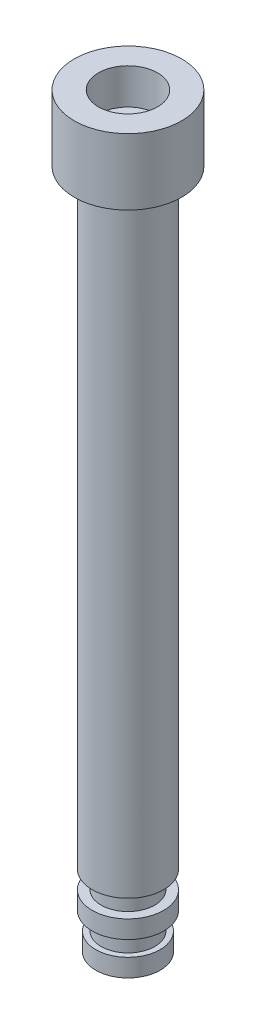
ISO-10303-21;
HEADER;
FILE_DESCRIPTION(('STEP AP214'),'2;1');
FILE_NAME('part.step','',(''),(''),'','','');
FILE_SCHEMA(('AUTOMOTIVE_DESIGN { 1 0 10303 214 1 1 1 1 }'));
ENDSEC;
DATA;
#1=APPLICATION_CONTEXT('core data for automotive mechanical design processes');
#2=APPLICATION_PROTOCOL_DEFINITION('international standard','automotive_design',2000,#1);
#3=PRODUCT_CONTEXT('',#1,'mechanical');
#4=PRODUCT('Part','Part','',(#3));
#5=PRODUCT_RELATED_PRODUCT_CATEGORY('part','',(#4));
#6=PRODUCT_DEFINITION_FORMATION('','',#4);
#7=PRODUCT_DEFINITION_CONTEXT('part definition',#1,'design');
#8=PRODUCT_DEFINITION('design','',#6,#7);
#9=PRODUCT_DEFINITION_SHAPE('','',#8);
#10=(LENGTH_UNIT() NAMED_UNIT(*) SI_UNIT(.MILLI.,.METRE.));
#11=(NAMED_UNIT(*) PLANE_ANGLE_UNIT() SI_UNIT($,.RADIAN.));
#12=(NAMED_UNIT(*) SI_UNIT($,.STERADIAN.) SOLID_ANGLE_UNIT());
#13=UNCERTAINTY_MEASURE_WITH_UNIT(LENGTH_MEASURE(1.E-05),#10,'distance_accuracy_value','');
#14=(GEOMETRIC_REPRESENTATION_CONTEXT(3) GLOBAL_UNCERTAINTY_ASSIGNED_CONTEXT((#13)) GLOBAL_UNIT_ASSIGNED_CONTEXT((#10,
#11,#12)) REPRESENTATION_CONTEXT('',''));
#15=CARTESIAN_POINT('',(0.,0.,0.));
#16=DIRECTION('',(0.,0.,1.));
#17=DIRECTION('',(1.,0.,0.));
#18=AXIS2_PLACEMENT_3D('',#15,#16,#17);
#19=CARTESIAN_POINT('',(-0.522013311509166,-38.,-0.51113803418606));
#20=DIRECTION('',(0.,1.,0.));
#21=DIRECTION('',(0.,0.,1.));
#22=AXIS2_PLACEMENT_3D('',#19,#20,#21);
#23=CYLINDRICAL_SURFACE('',#22,1.5);
#24=CARTESIAN_POINT('',(-0.522013311509166,-36.,-0.51113803418606));
#25=DIRECTION('',(0.,-1.,0.));
#26=DIRECTION('',(0.,0.,-1.));
#27=AXIS2_PLACEMENT_3D('',#24,#25,#26);
#28=CIRCLE('',#27,1.5);
#29=CARTESIAN_POINT('',(-0.522013311509166,-36.,-2.01113803418606));
#30=VERTEX_POINT('',#29);
#31=EDGE_CURVE('E58',#30,#30,#28,.T.);
#32=ORIENTED_EDGE('',*,*,#31,.T.);
#33=EDGE_LOOP('',(#32));
#34=FACE_BOUND('',#33,.T.);
#35=CARTESIAN_POINT('',(-0.522013311509166,-37.,-0.51113803418606));
#36=DIRECTION('',(0.,-1.,0.));
#37=DIRECTION('',(0.,0.,-1.));
#38=AXIS2_PLACEMENT_3D('',#35,#36,#37);
#39=CIRCLE('',#38,1.5);
#40=CARTESIAN_POINT('',(-0.522013311509166,-37.,-2.01113803418606));
#41=VERTEX_POINT('',#40);
#42=EDGE_CURVE('E53',#41,#41,#39,.T.);
#43=ORIENTED_EDGE('',*,*,#42,.F.);
#44=EDGE_LOOP('',(#43));
#45=FACE_BOUND('',#44,.T.);
#46=ADVANCED_FACE('F45',(#34,#45),#23,.T.);
#47=CARTESIAN_POINT('',(-0.522013311509166,-35.,-0.51113803418606));
#48=DIRECTION('',(0.,1.,0.));
#49=DIRECTION('',(0.,0.,1.));
#50=AXIS2_PLACEMENT_3D('',#47,#48,#49);
#51=CYLINDRICAL_SURFACE('',#50,1.5);
#52=CARTESIAN_POINT('',(-0.522013311509166,-34.,-0.51113803418606));
#53=DIRECTION('',(0.,-1.,0.));
#54=DIRECTION('',(0.,0.,-1.));
#55=AXIS2_PLACEMENT_3D('',#52,#53,#54);
#56=CIRCLE('',#55,1.5);
#57=CARTESIAN_POINT('',(-0.522013311509166,-34.,-2.01113803418606));
#58=VERTEX_POINT('',#57);
#59=EDGE_CURVE('E69',#58,#58,#56,.T.);
#60=ORIENTED_EDGE('',*,*,#59,.T.);
#61=EDGE_LOOP('',(#60));
#62=FACE_BOUND('',#61,.T.);
#63=CARTESIAN_POINT('',(-0.522013311509166,-35.,-0.51113803418606));
#64=DIRECTION('',(0.,-1.,0.));
#65=DIRECTION('',(0.,0.,-1.));
#66=AXIS2_PLACEMENT_3D('',#63,#64,#65);
#67=CIRCLE('',#66,1.5);
#68=CARTESIAN_POINT('',(-0.522013311509166,-35.,-2.01113803418606));
#69=VERTEX_POINT('',#68);
#70=EDGE_CURVE('E102',#69,#69,#67,.T.);
#71=ORIENTED_EDGE('',*,*,#70,.F.);
#72=EDGE_LOOP('',(#71));
#73=FACE_BOUND('',#72,.T.);
#74=ADVANCED_FACE('F127',(#62,#73),#51,.T.);
#75=CARTESIAN_POINT('',(-0.522013311509166,-36.,-0.51113803418606));
#76=DIRECTION('',(0.,1.,0.));
#77=DIRECTION('',(0.,0.,1.));
#78=AXIS2_PLACEMENT_3D('',#75,#76,#77);
#79=CYLINDRICAL_SURFACE('',#78,2.);
#80=CARTESIAN_POINT('',(-0.522013311509166,-36.,-0.51113803418606));
#81=DIRECTION('',(0.,-1.,0.));
#82=DIRECTION('',(0.,0.,-1.));
#83=AXIS2_PLACEMENT_3D('',#80,#81,#82);
#84=CIRCLE('',#83,2.);
#85=CARTESIAN_POINT('',(-0.522013311509166,-36.,-2.51113803418606));
#86=VERTEX_POINT('',#85);
#87=EDGE_CURVE('E98',#86,#86,#84,.T.);
#88=ORIENTED_EDGE('',*,*,#87,.F.);
#89=EDGE_LOOP('',(#88));
#90=FACE_BOUND('',#89,.T.);
#91=CARTESIAN_POINT('',(-0.522013311509166,-35.,-0.51113803418606));
#92=DIRECTION('',(0.,-1.,0.));
#93=DIRECTION('',(0.,0.,-1.));
#94=AXIS2_PLACEMENT_3D('',#91,#92,#93);
#95=CIRCLE('',#94,2.);
#96=CARTESIAN_POINT('',(-0.522013311509166,-35.,-2.51113803418606));
#97=VERTEX_POINT('',#96);
#98=EDGE_CURVE('E94',#97,#97,#95,.T.);
#99=ORIENTED_EDGE('',*,*,#98,.T.);
#100=EDGE_LOOP('',(#99));
#101=FACE_BOUND('',#100,.T.);
#102=ADVANCED_FACE('F133',(#90,#101),#79,.T.);
#103=CARTESIAN_POINT('',(-0.522013311509166,-36.,-0.51113803418606));
#104=DIRECTION('',(0.,-1.,0.));
#105=DIRECTION('',(0.,0.,-1.));
#106=AXIS2_PLACEMENT_3D('',#103,#104,#105);
#107=PLANE('',#106);
#108=ORIENTED_EDGE('',*,*,#31,.F.);
#109=EDGE_LOOP('',(#108));
#110=FACE_BOUND('',#109,.T.);
#111=ORIENTED_EDGE('',*,*,#87,.T.);
#112=EDGE_LOOP('',(#111));
#113=FACE_BOUND('',#112,.T.);
#114=ADVANCED_FACE('F140',(#110,#113),#107,.T.);
#115=CARTESIAN_POINT('',(-0.522013311509166,-35.,-0.51113803418606));
#116=DIRECTION('',(0.,-1.,0.));
#117=DIRECTION('',(0.,0.,-1.));
#118=AXIS2_PLACEMENT_3D('',#115,#116,#117);
#119=PLANE('',#118);
#120=ORIENTED_EDGE('',*,*,#70,.T.);
#121=EDGE_LOOP('',(#120));
#122=FACE_BOUND('',#121,.T.);
#123=ORIENTED_EDGE('',*,*,#98,.F.);
#124=EDGE_LOOP('',(#123));
#125=FACE_BOUND('',#124,.T.);
#126=ADVANCED_FACE('F143',(#122,#125),#119,.F.);
#127=CARTESIAN_POINT('',(-0.522013311509166,-37.,-0.51113803418606));
#128=DIRECTION('',(0.,-1.,0.));
#129=DIRECTION('',(0.,0.,-1.));
#130=AXIS2_PLACEMENT_3D('',#127,#128,#129);
#131=CYLINDRICAL_SURFACE('',#130,1.8);
#132=CARTESIAN_POINT('',(-0.522013311509166,-37.,-0.51113803418606));
#133=DIRECTION('',(0.,-1.,0.));
#134=DIRECTION('',(0.,0.,-1.));
#135=AXIS2_PLACEMENT_3D('',#132,#133,#134);
#136=CIRCLE('',#135,1.8);
#137=CARTESIAN_POINT('',(-0.522013311509166,-37.,-2.31113803418606));
#138=VERTEX_POINT('',#137);
#139=EDGE_CURVE('E90',#138,#138,#136,.T.);
#140=ORIENTED_EDGE('',*,*,#139,.T.);
#141=EDGE_LOOP('',(#140));
#142=FACE_BOUND('',#141,.T.);
#143=CARTESIAN_POINT('',(-0.522013311509166,-38.,-0.51113803418606));
#144=DIRECTION('',(0.,-1.,0.));
#145=DIRECTION('',(0.,0.,-1.));
#146=AXIS2_PLACEMENT_3D('',#143,#144,#145);
#147=CIRCLE('',#146,1.8);
#148=CARTESIAN_POINT('',(-0.522013311509166,-38.,-2.31113803418606));
#149=VERTEX_POINT('',#148);
#150=EDGE_CURVE('E88',#149,#149,#147,.T.);
#151=ORIENTED_EDGE('',*,*,#150,.F.);
#152=EDGE_LOOP('',(#151));
#153=FACE_BOUND('',#152,.T.);
#154=ADVANCED_FACE('F147',(#142,#153),#131,.T.);
#155=CARTESIAN_POINT('',(-0.522013311509166,-37.,-0.51113803418606));
#156=DIRECTION('',(0.,-1.,0.));
#157=DIRECTION('',(0.,0.,-1.));
#158=AXIS2_PLACEMENT_3D('',#155,#156,#157);
#159=PLANE('',#158);
#160=ORIENTED_EDGE('',*,*,#42,.T.);
#161=EDGE_LOOP('',(#160));
#162=FACE_BOUND('',#161,.T.);
#163=ORIENTED_EDGE('',*,*,#139,.F.);
#164=EDGE_LOOP('',(#163));
#165=FACE_BOUND('',#164,.T.);
#166=ADVANCED_FACE('F171',(#162,#165),#159,.F.);
#167=CARTESIAN_POINT('',(-0.522013311509166,-38.,-0.51113803418606));
#168=DIRECTION('',(0.,-1.,0.));
#169=DIRECTION('',(0.,0.,-1.));
#170=AXIS2_PLACEMENT_3D('',#167,#168,#169);
#171=PLANE('',#170);
#172=ORIENTED_EDGE('',*,*,#150,.T.);
#173=EDGE_LOOP('',(#172));
#174=FACE_BOUND('',#173,.T.);
#175=ADVANCED_FACE('F138',(#174),#171,.T.);
#176=CARTESIAN_POINT('',(-0.522013311509166,-34.,-0.51113803418606));
#177=DIRECTION('',(0.,1.,0.));
#178=DIRECTION('',(0.,0.,1.));
#179=AXIS2_PLACEMENT_3D('',#176,#177,#178);
#180=CYLINDRICAL_SURFACE('',#179,2.);
#181=CARTESIAN_POINT('',(-0.522013311509166,-34.,-0.51113803418606));
#182=DIRECTION('',(0.,-1.,0.));
#183=DIRECTION('',(0.,0.,-1.));
#184=AXIS2_PLACEMENT_3D('',#181,#182,#183);
#185=CIRCLE('',#184,2.);
#186=CARTESIAN_POINT('',(-0.522013311509166,-34.,-2.51113803418606));
#187=VERTEX_POINT('',#186);
#188=EDGE_CURVE('E73',#187,#187,#185,.T.);
#189=ORIENTED_EDGE('',*,*,#188,.F.);
#190=EDGE_LOOP('',(#189));
#191=FACE_BOUND('',#190,.T.);
#192=CARTESIAN_POINT('',(-0.522013311509166,0.,-0.51113803418606));
#193=DIRECTION('',(0.,1.,0.));
#194=DIRECTION('',(0.,0.,1.));
#195=AXIS2_PLACEMENT_3D('',#192,#193,#194);
#196=CIRCLE('',#195,2.);
#197=CARTESIAN_POINT('',(-0.522013311509166,0.,1.48886196581394));
#198=VERTEX_POINT('',#197);
#199=EDGE_CURVE('E10',#198,#198,#196,.F.);
#200=ORIENTED_EDGE('',*,*,#199,.T.);
#201=EDGE_LOOP('',(#200));
#202=FACE_BOUND('',#201,.T.);
#203=ADVANCED_FACE('F182',(#191,#202),#180,.T.);
#204=CARTESIAN_POINT('',(-0.522013311509166,-34.,-0.51113803418606));
#205=DIRECTION('',(0.,-1.,0.));
#206=DIRECTION('',(0.,0.,-1.));
#207=AXIS2_PLACEMENT_3D('',#204,#205,#206);
#208=PLANE('',#207);
#209=ORIENTED_EDGE('',*,*,#59,.F.);
#210=EDGE_LOOP('',(#209));
#211=FACE_BOUND('',#210,.T.);
#212=ORIENTED_EDGE('',*,*,#188,.T.);
#213=EDGE_LOOP('',(#212));
#214=FACE_BOUND('',#213,.T.);
#215=ADVANCED_FACE('F165',(#211,#214),#208,.T.);
#216=CARTESIAN_POINT('',(-0.522013311509166,1.7,-0.51113803418606));
#217=DIRECTION('',(0.,1.,0.));
#218=DIRECTION('',(0.,0.,1.));
#219=AXIS2_PLACEMENT_3D('',#216,#217,#218);
#220=PLANE('',#219);
#221=CARTESIAN_POINT('',(-0.522013311509166,1.7,-0.51113803418606));
#222=DIRECTION('',(0.,1.,0.));
#223=DIRECTION('',(0.,0.,1.));
#224=AXIS2_PLACEMENT_3D('',#221,#222,#223);
#225=CIRCLE('',#224,1.65);
#226=CARTESIAN_POINT('',(-0.522013311509166,1.7,1.13886196581394));
#227=VERTEX_POINT('',#226);
#228=EDGE_CURVE('E79',#227,#227,#225,.T.);
#229=ORIENTED_EDGE('',*,*,#228,.T.);
#230=EDGE_LOOP('',(#229));
#231=FACE_BOUND('',#230,.T.);
#232=ADVANCED_FACE('F157',(#231),#220,.T.);
#233=CARTESIAN_POINT('',(-0.522013311509166,1.7,-0.51113803418606));
#234=DIRECTION('',(0.,1.,0.));
#235=DIRECTION('',(0.,0.,1.));
#236=AXIS2_PLACEMENT_3D('',#233,#234,#235);
#237=CYLINDRICAL_SURFACE('',#236,1.65);
#238=ORIENTED_EDGE('',*,*,#228,.F.);
#239=EDGE_LOOP('',(#238));
#240=FACE_BOUND('',#239,.T.);
#241=CARTESIAN_POINT('',(-0.522013311509166,3.7,-0.51113803418606));
#242=DIRECTION('',(0.,1.,0.));
#243=DIRECTION('',(0.,0.,1.));
#244=AXIS2_PLACEMENT_3D('',#241,#242,#243);
#245=CIRCLE('',#244,1.65);
#246=CARTESIAN_POINT('',(-0.522013311509166,3.7,1.13886196581394));
#247=VERTEX_POINT('',#246);
#248=EDGE_CURVE('E72',#247,#247,#245,.T.);
#249=ORIENTED_EDGE('',*,*,#248,.T.);
#250=EDGE_LOOP('',(#249));
#251=FACE_BOUND('',#250,.T.);
#252=ADVANCED_FACE('F152',(#240,#251),#237,.F.);
#253=CARTESIAN_POINT('',(-0.522013311509166,3.7,-0.51113803418606));
#254=DIRECTION('',(0.,1.,0.));
#255=DIRECTION('',(0.,0.,1.));
#256=AXIS2_PLACEMENT_3D('',#253,#254,#255);
#257=PLANE('',#256);
#258=ORIENTED_EDGE('',*,*,#248,.F.);
#259=EDGE_LOOP('',(#258));
#260=FACE_BOUND('',#259,.T.);
#261=CARTESIAN_POINT('',(-0.522013311509166,3.7,-0.51113803418606));
#262=DIRECTION('',(0.,1.,0.));
#263=DIRECTION('',(0.,0.,1.));
#264=AXIS2_PLACEMENT_3D('',#261,#262,#263);
#265=CIRCLE('',#264,3.);
#266=CARTESIAN_POINT('',(-0.522013311509166,3.7,2.48886196581394));
#267=VERTEX_POINT('',#266);
#268=EDGE_CURVE('E64',#267,#267,#265,.T.);
#269=ORIENTED_EDGE('',*,*,#268,.T.);
#270=EDGE_LOOP('',(#269));
#271=FACE_BOUND('',#270,.T.);
#272=ADVANCED_FACE('F123',(#260,#271),#257,.T.);
#273=CARTESIAN_POINT('',(-0.522013311509166,3.7,-0.51113803418606));
#274=DIRECTION('',(0.,-1.,0.));
#275=DIRECTION('',(0.,0.,-1.));
#276=AXIS2_PLACEMENT_3D('',#273,#274,#275);
#277=CYLINDRICAL_SURFACE('',#276,3.);
#278=ORIENTED_EDGE('',*,*,#268,.F.);
#279=EDGE_LOOP('',(#278));
#280=FACE_BOUND('',#279,.T.);
#281=CARTESIAN_POINT('',(-0.522013311509166,0.,-0.51113803418606));
#282=DIRECTION('',(0.,1.,0.));
#283=DIRECTION('',(0.,0.,1.));
#284=AXIS2_PLACEMENT_3D('',#281,#282,#283);
#285=CIRCLE('',#284,3.);
#286=CARTESIAN_POINT('',(-0.522013311509166,0.,2.48886196581394));
#287=VERTEX_POINT('',#286);
#288=EDGE_CURVE('E67',#287,#287,#285,.T.);
#289=ORIENTED_EDGE('',*,*,#288,.T.);
#290=EDGE_LOOP('',(#289));
#291=FACE_BOUND('',#290,.T.);
#292=ADVANCED_FACE('F47',(#280,#291),#277,.T.);
#293=CARTESIAN_POINT('',(-0.522013311509166,0.,-0.51113803418606));
#294=DIRECTION('',(0.,1.,0.));
#295=DIRECTION('',(0.,0.,1.));
#296=AXIS2_PLACEMENT_3D('',#293,#294,#295);
#297=PLANE('',#296);
#298=ORIENTED_EDGE('',*,*,#199,.F.);
#299=EDGE_LOOP('',(#298));
#300=FACE_BOUND('',#299,.T.);
#301=ORIENTED_EDGE('',*,*,#288,.F.);
#302=EDGE_LOOP('',(#301));
#303=FACE_BOUND('',#302,.T.);
#304=ADVANCED_FACE('F117',(#300,#303),#297,.F.);
#305=CLOSED_SHELL('',(#46,#74,#102,#114,#126,#154,#166,#175,#203,#215,#232,#252,#272,#292,#304));
#306=MANIFOLD_SOLID_BREP('B2',#305);
#307=ADVANCED_BREP_SHAPE_REPRESENTATION('',(#18,#306),#14);
#308=SHAPE_DEFINITION_REPRESENTATION(#9,#307);
ENDSEC;
END-ISO-10303-21;
